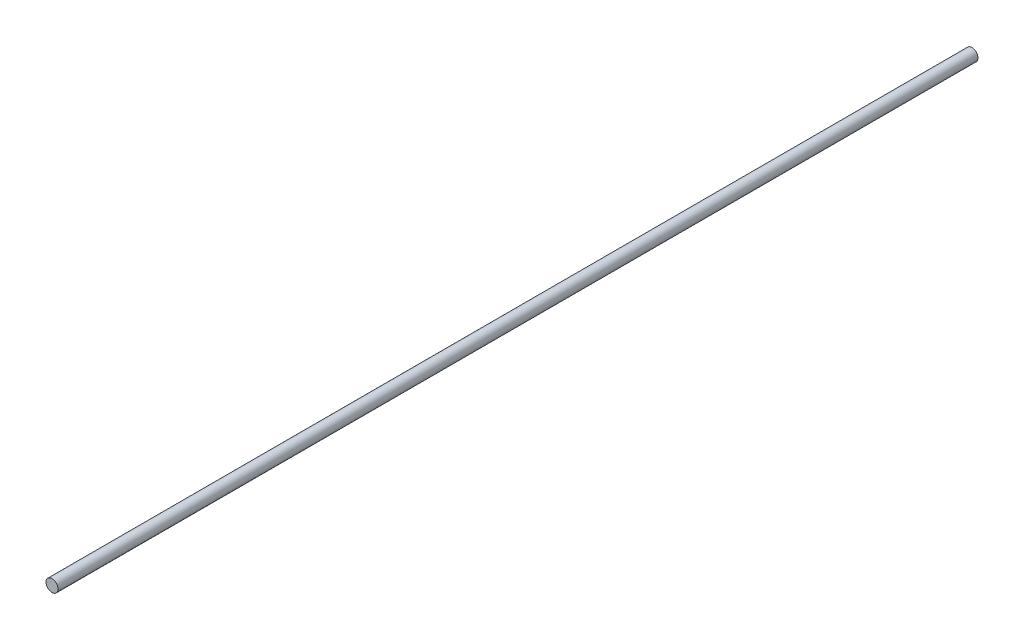
ISO-10303-21;
HEADER;
FILE_DESCRIPTION(('STEP AP214'),'2;1');
FILE_NAME('part.step','',(''),(''),'','','');
FILE_SCHEMA(('AUTOMOTIVE_DESIGN { 1 0 10303 214 1 1 1 1 }'));
ENDSEC;
DATA;
#1=APPLICATION_CONTEXT('core data for automotive mechanical design processes');
#2=APPLICATION_PROTOCOL_DEFINITION('international standard','automotive_design',2000,#1);
#3=PRODUCT_CONTEXT('',#1,'mechanical');
#4=PRODUCT('Part','Part','',(#3));
#5=PRODUCT_RELATED_PRODUCT_CATEGORY('part','',(#4));
#6=PRODUCT_DEFINITION_FORMATION('','',#4);
#7=PRODUCT_DEFINITION_CONTEXT('part definition',#1,'design');
#8=PRODUCT_DEFINITION('design','',#6,#7);
#9=PRODUCT_DEFINITION_SHAPE('','',#8);
#10=(LENGTH_UNIT() NAMED_UNIT(*) SI_UNIT(.MILLI.,.METRE.));
#11=(NAMED_UNIT(*) PLANE_ANGLE_UNIT() SI_UNIT($,.RADIAN.));
#12=(NAMED_UNIT(*) SI_UNIT($,.STERADIAN.) SOLID_ANGLE_UNIT());
#13=UNCERTAINTY_MEASURE_WITH_UNIT(LENGTH_MEASURE(1.E-05),#10,'distance_accuracy_value','');
#14=(GEOMETRIC_REPRESENTATION_CONTEXT(3) GLOBAL_UNCERTAINTY_ASSIGNED_CONTEXT((#13)) GLOBAL_UNIT_ASSIGNED_CONTEXT((#10,
#11,#12)) REPRESENTATION_CONTEXT('',''));
#15=CARTESIAN_POINT('',(0.,0.,0.));
#16=DIRECTION('',(0.,0.,1.));
#17=DIRECTION('',(1.,0.,0.));
#18=AXIS2_PLACEMENT_3D('',#15,#16,#17);
#19=CARTESIAN_POINT('',(0.,0.,535.));
#20=DIRECTION('',(0.,0.,-1.));
#21=DIRECTION('',(-1.,0.,0.));
#22=AXIS2_PLACEMENT_3D('',#19,#20,#21);
#23=CYLINDRICAL_SURFACE('',#22,3.5);
#24=CARTESIAN_POINT('',(0.,0.,535.));
#25=DIRECTION('',(0.,0.,1.));
#26=DIRECTION('',(1.,0.,0.));
#27=AXIS2_PLACEMENT_3D('',#24,#25,#26);
#28=CIRCLE('',#27,3.5);
#29=CARTESIAN_POINT('',(3.5,0.,535.));
#30=VERTEX_POINT('',#29);
#31=EDGE_CURVE('E10',#30,#30,#28,.T.);
#32=ORIENTED_EDGE('',*,*,#31,.F.);
#33=EDGE_LOOP('',(#32));
#34=FACE_BOUND('',#33,.T.);
#35=CARTESIAN_POINT('',(0.,0.,0.));
#36=DIRECTION('',(0.,0.,1.));
#37=DIRECTION('',(1.,0.,0.));
#38=AXIS2_PLACEMENT_3D('',#35,#36,#37);
#39=CIRCLE('',#38,3.5);
#40=CARTESIAN_POINT('',(3.5,0.,0.));
#41=VERTEX_POINT('',#40);
#42=EDGE_CURVE('E34',#41,#41,#39,.T.);
#43=ORIENTED_EDGE('',*,*,#42,.T.);
#44=EDGE_LOOP('',(#43));
#45=FACE_BOUND('',#44,.T.);
#46=ADVANCED_FACE('F31',(#34,#45),#23,.T.);
#47=CARTESIAN_POINT('',(0.,0.,535.));
#48=DIRECTION('',(0.,0.,1.));
#49=DIRECTION('',(1.,0.,0.));
#50=AXIS2_PLACEMENT_3D('',#47,#48,#49);
#51=PLANE('',#50);
#52=ORIENTED_EDGE('',*,*,#31,.T.);
#53=EDGE_LOOP('',(#52));
#54=FACE_BOUND('',#53,.T.);
#55=ADVANCED_FACE('F46',(#54),#51,.T.);
#56=CARTESIAN_POINT('',(0.,0.,0.));
#57=DIRECTION('',(0.,0.,1.));
#58=DIRECTION('',(1.,0.,0.));
#59=AXIS2_PLACEMENT_3D('',#56,#57,#58);
#60=PLANE('',#59);
#61=ORIENTED_EDGE('',*,*,#42,.F.);
#62=EDGE_LOOP('',(#61));
#63=FACE_BOUND('',#62,.T.);
#64=ADVANCED_FACE('F44',(#63),#60,.F.);
#65=CLOSED_SHELL('',(#46,#55,#64));
#66=MANIFOLD_SOLID_BREP('B2',#65);
#67=ADVANCED_BREP_SHAPE_REPRESENTATION('',(#18,#66),#14);
#68=SHAPE_DEFINITION_REPRESENTATION(#9,#67);
ENDSEC;
END-ISO-10303-21;
